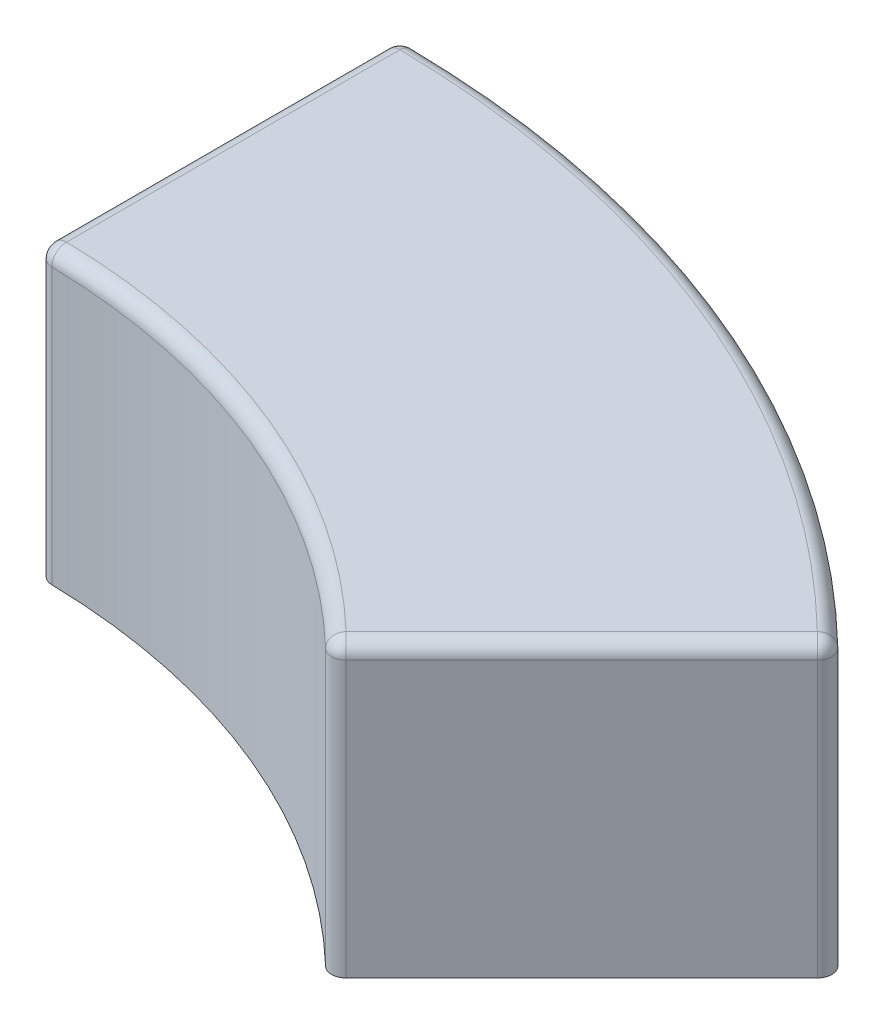
ISO-10303-21;
HEADER;
FILE_DESCRIPTION(('STEP AP214'),'2;1');
FILE_NAME('part.step','',(''),(''),'','','');
FILE_SCHEMA(('AUTOMOTIVE_DESIGN { 1 0 10303 214 1 1 1 1 }'));
ENDSEC;
DATA;
#1=APPLICATION_CONTEXT('core data for automotive mechanical design processes');
#2=APPLICATION_PROTOCOL_DEFINITION('international standard','automotive_design',2000,#1);
#3=PRODUCT_CONTEXT('',#1,'mechanical');
#4=PRODUCT('Part','Part','',(#3));
#5=PRODUCT_RELATED_PRODUCT_CATEGORY('part','',(#4));
#6=PRODUCT_DEFINITION_FORMATION('','',#4);
#7=PRODUCT_DEFINITION_CONTEXT('part definition',#1,'design');
#8=PRODUCT_DEFINITION('design','',#6,#7);
#9=PRODUCT_DEFINITION_SHAPE('','',#8);
#10=(LENGTH_UNIT() NAMED_UNIT(*) SI_UNIT(.MILLI.,.METRE.));
#11=(NAMED_UNIT(*) PLANE_ANGLE_UNIT() SI_UNIT($,.RADIAN.));
#12=(NAMED_UNIT(*) SI_UNIT($,.STERADIAN.) SOLID_ANGLE_UNIT());
#13=UNCERTAINTY_MEASURE_WITH_UNIT(LENGTH_MEASURE(1.E-05),#10,'distance_accuracy_value','');
#14=(GEOMETRIC_REPRESENTATION_CONTEXT(3) GLOBAL_UNCERTAINTY_ASSIGNED_CONTEXT((#13)) GLOBAL_UNIT_ASSIGNED_CONTEXT((#10,
#11,#12)) REPRESENTATION_CONTEXT('',''));
#15=CARTESIAN_POINT('',(0.,0.,0.));
#16=DIRECTION('',(0.,0.,1.));
#17=DIRECTION('',(1.,0.,0.));
#18=AXIS2_PLACEMENT_3D('',#15,#16,#17);
#19=CARTESIAN_POINT('',(0.,400.,0.));
#20=DIRECTION('',(0.,-1.,0.));
#21=DIRECTION('',(0.,0.,-1.));
#22=AXIS2_PLACEMENT_3D('',#19,#20,#21);
#23=CYLINDRICAL_SURFACE('',#22,1460.);
#24=CARTESIAN_POINT('',(0.,380.,0.));
#25=DIRECTION('',(0.,-1.,0.));
#26=DIRECTION('',(0.,0.,-1.));
#27=AXIS2_PLACEMENT_3D('',#24,#25,#26);
#28=CIRCLE('',#27,1460.);
#29=CARTESIAN_POINT('',(20.2777777777778,380.,-1459.85917530712));
#30=VERTEX_POINT('',#29);
#31=CARTESIAN_POINT('',(1017.93776826301,380.,-1046.61487661113));
#32=VERTEX_POINT('',#31);
#33=EDGE_CURVE('E234',#30,#32,#28,.T.);
#34=ORIENTED_EDGE('',*,*,#33,.T.);
#35=DIRECTION('',(0.,-1.,0.));
#36=VECTOR('',#35,1.);
#37=CARTESIAN_POINT('',(1017.93776826301,400.,-1046.61487661113));
#38=LINE('',#37,#36);
#39=CARTESIAN_POINT('',(1017.93776826301,0.,-1046.61487661113));
#40=VERTEX_POINT('',#39);
#41=EDGE_CURVE('E238',#32,#40,#38,.T.);
#42=ORIENTED_EDGE('',*,*,#41,.T.);
#43=CARTESIAN_POINT('',(0.,0.,0.));
#44=DIRECTION('',(0.,1.,0.));
#45=DIRECTION('',(0.,0.,-1.));
#46=AXIS2_PLACEMENT_3D('',#43,#44,#45);
#47=CIRCLE('',#46,1460.);
#48=CARTESIAN_POINT('',(20.2777777777778,0.,-1459.85917530712));
#49=VERTEX_POINT('',#48);
#50=EDGE_CURVE('E203',#40,#49,#47,.T.);
#51=ORIENTED_EDGE('',*,*,#50,.T.);
#52=DIRECTION('',(0.,-1.,0.));
#53=VECTOR('',#52,1.);
#54=CARTESIAN_POINT('',(20.2777777777778,400.,-1459.85917530712));
#55=LINE('',#54,#53);
#56=EDGE_CURVE('E231',#49,#30,#55,.F.);
#57=ORIENTED_EDGE('',*,*,#56,.T.);
#58=EDGE_LOOP('',(#34,#42,#51,#57));
#59=FACE_BOUND('',#58,.T.);
#60=ADVANCED_FACE('F47',(#59),#23,.T.);
#61=CARTESIAN_POINT('',(0.,400.,-960.));
#62=DIRECTION('',(1.,0.,0.));
#63=DIRECTION('',(0.,0.,-1.));
#64=AXIS2_PLACEMENT_3D('',#61,#62,#63);
#65=PLANE('',#64);
#66=DIRECTION('',(0.,0.,1.));
#67=VECTOR('',#66,1.);
#68=CARTESIAN_POINT('',(0.,380.,-960.));
#69=LINE('',#68,#67);
#70=CARTESIAN_POINT('',(0.,380.,-979.795897113271));
#71=VERTEX_POINT('',#70);
#72=CARTESIAN_POINT('',(0.,380.,-1439.86110441251));
#73=VERTEX_POINT('',#72);
#74=EDGE_CURVE('E265',#71,#73,#69,.F.);
#75=ORIENTED_EDGE('',*,*,#74,.T.);
#76=DIRECTION('',(0.,-1.,0.));
#77=VECTOR('',#76,1.);
#78=CARTESIAN_POINT('',(0.,400.,-1439.86110441251));
#79=LINE('',#78,#77);
#80=CARTESIAN_POINT('',(0.,0.,-1439.86110441251));
#81=VERTEX_POINT('',#80);
#82=EDGE_CURVE('E268',#73,#81,#79,.T.);
#83=ORIENTED_EDGE('',*,*,#82,.T.);
#84=DIRECTION('',(0.,0.,1.));
#85=VECTOR('',#84,1.);
#86=CARTESIAN_POINT('',(0.,0.,-960.));
#87=LINE('',#86,#85);
#88=CARTESIAN_POINT('',(0.,0.,-979.795897113271));
#89=VERTEX_POINT('',#88);
#90=EDGE_CURVE('E207',#81,#89,#87,.T.);
#91=ORIENTED_EDGE('',*,*,#90,.T.);
#92=DIRECTION('',(0.,-1.,0.));
#93=VECTOR('',#92,1.);
#94=CARTESIAN_POINT('',(0.,400.,-979.795897113271));
#95=LINE('',#94,#93);
#96=EDGE_CURVE('E262',#89,#71,#95,.F.);
#97=ORIENTED_EDGE('',*,*,#96,.T.);
#98=EDGE_LOOP('',(#75,#83,#91,#97));
#99=FACE_BOUND('',#98,.T.);
#100=ADVANCED_FACE('F376',(#99),#65,.F.);
#101=CARTESIAN_POINT('',(0.,400.,0.));
#102=DIRECTION('',(0.,-1.,0.));
#103=DIRECTION('',(0.,0.,-1.));
#104=AXIS2_PLACEMENT_3D('',#101,#102,#103);
#105=CYLINDRICAL_SURFACE('',#104,960.);
#106=CARTESIAN_POINT('',(0.,380.,0.));
#107=DIRECTION('',(0.,-1.,0.));
#108=DIRECTION('',(0.,0.,-1.));
#109=AXIS2_PLACEMENT_3D('',#106,#107,#108);
#110=CIRCLE('',#109,960.);
#111=CARTESIAN_POINT('',(664.827612150682,380.,-692.534653372683));
#112=VERTEX_POINT('',#111);
#113=CARTESIAN_POINT('',(19.5918367346939,380.,-959.800062478306));
#114=VERTEX_POINT('',#113);
#115=EDGE_CURVE('E57',#112,#114,#110,.F.);
#116=ORIENTED_EDGE('',*,*,#115,.T.);
#117=DIRECTION('',(0.,-1.,0.));
#118=VECTOR('',#117,1.);
#119=CARTESIAN_POINT('',(19.5918367346939,400.,-959.800062478307));
#120=LINE('',#119,#118);
#121=CARTESIAN_POINT('',(19.5918367346939,0.,-959.800062478306));
#122=VERTEX_POINT('',#121);
#123=EDGE_CURVE('E11',#114,#122,#120,.T.);
#124=ORIENTED_EDGE('',*,*,#123,.T.);
#125=CARTESIAN_POINT('',(0.,0.,0.));
#126=DIRECTION('',(0.,-1.,0.));
#127=DIRECTION('',(0.,0.,-1.));
#128=AXIS2_PLACEMENT_3D('',#125,#126,#127);
#129=CIRCLE('',#128,960.);
#130=CARTESIAN_POINT('',(664.827612150682,0.,-692.534653372683));
#131=VERTEX_POINT('',#130);
#132=EDGE_CURVE('E211',#122,#131,#129,.T.);
#133=ORIENTED_EDGE('',*,*,#132,.T.);
#134=DIRECTION('',(0.,-1.,0.));
#135=VECTOR('',#134,1.);
#136=CARTESIAN_POINT('',(664.827612150682,400.,-692.534653372683));
#137=LINE('',#136,#135);
#138=EDGE_CURVE('E68',#131,#112,#137,.F.);
#139=ORIENTED_EDGE('',*,*,#138,.T.);
#140=EDGE_LOOP('',(#116,#124,#133,#139));
#141=FACE_BOUND('',#140,.T.);
#142=ADVANCED_FACE('F348',(#141),#105,.F.);
#143=CARTESIAN_POINT('',(678.822509939087,400.,-678.822509939084));
#144=DIRECTION('',(-0.707106781186547,0.,-0.707106781186549));
#145=DIRECTION('',(-0.707106781186549,0.,0.707106781186547));
#146=AXIS2_PLACEMENT_3D('',#143,#144,#145);
#147=PLANE('',#146);
#148=DIRECTION('',(0.707106781186549,0.,-0.707106781186547));
#149=VECTOR('',#148,1.);
#150=CARTESIAN_POINT('',(678.822509939087,0.,-678.822509939084));
#151=LINE('',#150,#149);
#152=CARTESIAN_POINT('',(692.820323027552,0.,-692.82032302755));
#153=VERTEX_POINT('',#152);
#154=CARTESIAN_POINT('',(1018.13555089684,0.,-1018.13555089683));
#155=VERTEX_POINT('',#154);
#156=EDGE_CURVE('E214',#153,#155,#151,.T.);
#157=ORIENTED_EDGE('',*,*,#156,.T.);
#158=DIRECTION('',(0.,-1.,0.));
#159=VECTOR('',#158,1.);
#160=CARTESIAN_POINT('',(1018.13555089684,400.,-1018.13555089683));
#161=LINE('',#160,#159);
#162=CARTESIAN_POINT('',(1018.13555089684,380.,-1018.13555089683));
#163=VERTEX_POINT('',#162);
#164=EDGE_CURVE('E259',#155,#163,#161,.F.);
#165=ORIENTED_EDGE('',*,*,#164,.T.);
#166=DIRECTION('',(0.707106781186549,0.,-0.707106781186547));
#167=VECTOR('',#166,1.);
#168=CARTESIAN_POINT('',(678.822509939087,380.,-678.822509939084));
#169=LINE('',#168,#167);
#170=CARTESIAN_POINT('',(692.820323027552,380.,-692.82032302755));
#171=VERTEX_POINT('',#170);
#172=EDGE_CURVE('E256',#163,#171,#169,.F.);
#173=ORIENTED_EDGE('',*,*,#172,.T.);
#174=DIRECTION('',(0.,-1.,0.));
#175=VECTOR('',#174,1.);
#176=CARTESIAN_POINT('',(692.820323027552,400.,-692.82032302755));
#177=LINE('',#176,#175);
#178=EDGE_CURVE('E253',#171,#153,#177,.T.);
#179=ORIENTED_EDGE('',*,*,#178,.T.);
#180=EDGE_LOOP('',(#157,#165,#173,#179));
#181=FACE_BOUND('',#180,.T.);
#182=ADVANCED_FACE('F356',(#181),#147,.F.);
#183=CARTESIAN_POINT('',(0.,400.,0.));
#184=DIRECTION('',(0.,-1.,0.));
#185=DIRECTION('',(0.,0.,-1.));
#186=AXIS2_PLACEMENT_3D('',#183,#184,#185);
#187=PLANE('',#186);
#188=DIRECTION('',(0.707106781186549,0.,-0.707106781186547));
#189=VECTOR('',#188,1.);
#190=CARTESIAN_POINT('',(-14.1421356237306,400.,-14.1421356237306));
#191=LINE('',#190,#189);
#192=CARTESIAN_POINT('',(678.678187403821,400.,-706.96245865128));
#193=VERTEX_POINT('',#192);
#194=CARTESIAN_POINT('',(1003.99341527311,400.,-1032.27768652056));
#195=VERTEX_POINT('',#194);
#196=EDGE_CURVE('E218',#193,#195,#191,.T.);
#197=ORIENTED_EDGE('',*,*,#196,.T.);
#198=CARTESIAN_POINT('',(0.,400.,0.));
#199=DIRECTION('',(0.,-1.,0.));
#200=DIRECTION('',(0.,0.,-1.));
#201=AXIS2_PLACEMENT_3D('',#198,#199,#200);
#202=CIRCLE('',#201,1440.);
#203=CARTESIAN_POINT('',(20.,400.,-1439.86110441251));
#204=VERTEX_POINT('',#203);
#205=EDGE_CURVE('E227',#195,#204,#202,.F.);
#206=ORIENTED_EDGE('',*,*,#205,.T.);
#207=DIRECTION('',(0.,0.,1.));
#208=VECTOR('',#207,1.);
#209=CARTESIAN_POINT('',(20.,400.,0.));
#210=LINE('',#209,#208);
#211=CARTESIAN_POINT('',(20.,400.,-979.795897113271));
#212=VERTEX_POINT('',#211);
#213=EDGE_CURVE('E224',#204,#212,#210,.T.);
#214=ORIENTED_EDGE('',*,*,#213,.T.);
#215=CARTESIAN_POINT('',(0.,400.,0.));
#216=DIRECTION('',(0.,-1.,0.));
#217=DIRECTION('',(0.,0.,-1.));
#218=AXIS2_PLACEMENT_3D('',#215,#216,#217);
#219=CIRCLE('',#218,980.);
#220=EDGE_CURVE('E221',#212,#193,#219,.T.);
#221=ORIENTED_EDGE('',*,*,#220,.T.);
#222=EDGE_LOOP('',(#197,#206,#214,#221));
#223=FACE_BOUND('',#222,.T.);
#224=ADVANCED_FACE('F331',(#223),#187,.F.);
#225=CARTESIAN_POINT('',(0.,0.,0.));
#226=DIRECTION('',(0.,-1.,0.));
#227=DIRECTION('',(0.,0.,-1.));
#228=AXIS2_PLACEMENT_3D('',#225,#226,#227);
#229=PLANE('',#228);
#230=ORIENTED_EDGE('',*,*,#50,.F.);
#231=CARTESIAN_POINT('',(1003.9934152731,0.,-1032.27768652056));
#232=DIRECTION('',(0.,-1.,0.));
#233=DIRECTION('',(0.,0.,-1.));
#234=AXIS2_PLACEMENT_3D('',#231,#232,#233);
#235=CIRCLE('',#234,20.);
#236=EDGE_CURVE('E250',#40,#155,#235,.T.);
#237=ORIENTED_EDGE('',*,*,#236,.T.);
#238=ORIENTED_EDGE('',*,*,#156,.F.);
#239=CARTESIAN_POINT('',(678.678187403821,0.,-706.962458651281));
#240=DIRECTION('',(0.,-1.,0.));
#241=DIRECTION('',(0.,0.,-1.));
#242=AXIS2_PLACEMENT_3D('',#239,#240,#241);
#243=CIRCLE('',#242,20.);
#244=EDGE_CURVE('E241',#153,#131,#243,.T.);
#245=ORIENTED_EDGE('',*,*,#244,.T.);
#246=ORIENTED_EDGE('',*,*,#132,.F.);
#247=CARTESIAN_POINT('',(20.,0.,-979.795897113271));
#248=DIRECTION('',(0.,-1.,0.));
#249=DIRECTION('',(0.,0.,-1.));
#250=AXIS2_PLACEMENT_3D('',#247,#248,#249);
#251=CIRCLE('',#250,20.);
#252=EDGE_CURVE('E244',#122,#89,#251,.T.);
#253=ORIENTED_EDGE('',*,*,#252,.T.);
#254=ORIENTED_EDGE('',*,*,#90,.F.);
#255=CARTESIAN_POINT('',(20.,0.,-1439.86110441251));
#256=DIRECTION('',(0.,-1.,0.));
#257=DIRECTION('',(0.,0.,-1.));
#258=AXIS2_PLACEMENT_3D('',#255,#256,#257);
#259=CIRCLE('',#258,20.);
#260=EDGE_CURVE('E247',#81,#49,#259,.T.);
#261=ORIENTED_EDGE('',*,*,#260,.T.);
#262=EDGE_LOOP('',(#230,#237,#238,#245,#246,#253,#254,#261));
#263=FACE_BOUND('',#262,.T.);
#264=ADVANCED_FACE('F351',(#263),#229,.T.);
#265=CARTESIAN_POINT('',(678.678187403821,400.,-706.962458651281));
#266=DIRECTION('',(0.,-1.,0.));
#267=DIRECTION('',(0.,0.,-1.));
#268=AXIS2_PLACEMENT_3D('',#265,#266,#267);
#269=CYLINDRICAL_SURFACE('',#268,20.);
#270=ORIENTED_EDGE('',*,*,#244,.F.);
#271=ORIENTED_EDGE('',*,*,#178,.F.);
#272=CARTESIAN_POINT('',(678.678187403821,380.,-706.962458651281));
#273=DIRECTION('',(0.,1.,0.));
#274=DIRECTION('',(0.,0.,1.));
#275=AXIS2_PLACEMENT_3D('',#272,#273,#274);
#276=CIRCLE('',#275,20.);
#277=EDGE_CURVE('E51',#112,#171,#276,.T.);
#278=ORIENTED_EDGE('',*,*,#277,.F.);
#279=ORIENTED_EDGE('',*,*,#138,.F.);
#280=EDGE_LOOP('',(#270,#271,#278,#279));
#281=FACE_BOUND('',#280,.T.);
#282=ADVANCED_FACE('F49',(#281),#269,.T.);
#283=CARTESIAN_POINT('',(0.,380.,0.));
#284=DIRECTION('',(0.,-1.,0.));
#285=DIRECTION('',(0.,0.,-1.));
#286=AXIS2_PLACEMENT_3D('',#283,#284,#285);
#287=TOROIDAL_SURFACE('',#286,980.,20.);
#288=CARTESIAN_POINT('',(20.,380.,-979.795897113271));
#289=DIRECTION('',(-0.999791731748236,0.,-0.0204081632653062));
#290=DIRECTION('',(-0.0204081632653062,0.,0.999791731748236));
#291=AXIS2_PLACEMENT_3D('',#288,#289,#290);
#292=CIRCLE('',#291,20.);
#293=EDGE_CURVE('E308',#114,#212,#292,.T.);
#294=ORIENTED_EDGE('',*,*,#293,.F.);
#295=ORIENTED_EDGE('',*,*,#115,.F.);
#296=CARTESIAN_POINT('',(678.678187403821,380.,-706.96245865128));
#297=DIRECTION('',(0.721390263929871,0.,0.692528762656968));
#298=DIRECTION('',(0.692528762656968,0.,-0.721390263929871));
#299=AXIS2_PLACEMENT_3D('',#296,#297,#298);
#300=CIRCLE('',#299,20.);
#301=EDGE_CURVE('E311',#193,#112,#300,.T.);
#302=ORIENTED_EDGE('',*,*,#301,.F.);
#303=ORIENTED_EDGE('',*,*,#220,.F.);
#304=EDGE_LOOP('',(#294,#295,#302,#303));
#305=FACE_BOUND('',#304,.T.);
#306=ADVANCED_FACE('F337',(#305),#287,.T.);
#307=CARTESIAN_POINT('',(20.,400.,-979.795897113271));
#308=DIRECTION('',(0.,-1.,0.));
#309=DIRECTION('',(0.,0.,-1.));
#310=AXIS2_PLACEMENT_3D('',#307,#308,#309);
#311=CYLINDRICAL_SURFACE('',#310,20.);
#312=ORIENTED_EDGE('',*,*,#252,.F.);
#313=ORIENTED_EDGE('',*,*,#123,.F.);
#314=CARTESIAN_POINT('',(20.,380.,-979.795897113271));
#315=DIRECTION('',(0.,1.,0.));
#316=DIRECTION('',(0.,0.,1.));
#317=AXIS2_PLACEMENT_3D('',#314,#315,#316);
#318=CIRCLE('',#317,20.);
#319=EDGE_CURVE('E304',#71,#114,#318,.T.);
#320=ORIENTED_EDGE('',*,*,#319,.F.);
#321=ORIENTED_EDGE('',*,*,#96,.F.);
#322=EDGE_LOOP('',(#312,#313,#320,#321));
#323=FACE_BOUND('',#322,.T.);
#324=ADVANCED_FACE('F346',(#323),#311,.T.);
#325=CARTESIAN_POINT('',(678.678187403821,380.,-706.962458651281));
#326=DIRECTION('',(0.,1.,0.));
#327=DIRECTION('',(0.,0.,1.));
#328=AXIS2_PLACEMENT_3D('',#325,#326,#327);
#329=SPHERICAL_SURFACE('',#328,20.);
#330=ORIENTED_EDGE('',*,*,#301,.T.);
#331=ORIENTED_EDGE('',*,*,#277,.T.);
#332=CARTESIAN_POINT('',(678.678187403821,380.,-706.962458651281));
#333=DIRECTION('',(-0.70710678118655,0.,0.707106781186545));
#334=DIRECTION('',(0.707106781186545,0.,0.70710678118655));
#335=AXIS2_PLACEMENT_3D('',#332,#333,#334);
#336=CIRCLE('',#335,20.);
#337=EDGE_CURVE('E300',#193,#171,#336,.F.);
#338=ORIENTED_EDGE('',*,*,#337,.F.);
#339=EDGE_LOOP('',(#330,#331,#338));
#340=FACE_BOUND('',#339,.T.);
#341=ADVANCED_FACE('F320',(#340),#329,.T.);
#342=CARTESIAN_POINT('',(20.,380.,-979.795897113271));
#343=DIRECTION('',(0.,1.,0.));
#344=DIRECTION('',(0.,0.,1.));
#345=AXIS2_PLACEMENT_3D('',#342,#343,#344);
#346=SPHERICAL_SURFACE('',#345,20.);
#347=ORIENTED_EDGE('',*,*,#319,.T.);
#348=ORIENTED_EDGE('',*,*,#293,.T.);
#349=CARTESIAN_POINT('',(20.,380.,-979.795897113271));
#350=DIRECTION('',(0.,0.,1.));
#351=DIRECTION('',(1.,0.,0.));
#352=AXIS2_PLACEMENT_3D('',#349,#350,#351);
#353=CIRCLE('',#352,20.);
#354=EDGE_CURVE('E296',#71,#212,#353,.F.);
#355=ORIENTED_EDGE('',*,*,#354,.F.);
#356=EDGE_LOOP('',(#347,#348,#355));
#357=FACE_BOUND('',#356,.T.);
#358=ADVANCED_FACE('F341',(#357),#346,.T.);
#359=CARTESIAN_POINT('',(1003.9934152731,400.,-1032.27768652056));
#360=DIRECTION('',(0.,-1.,0.));
#361=DIRECTION('',(0.,0.,-1.));
#362=AXIS2_PLACEMENT_3D('',#359,#360,#361);
#363=CYLINDRICAL_SURFACE('',#362,20.);
#364=ORIENTED_EDGE('',*,*,#236,.F.);
#365=ORIENTED_EDGE('',*,*,#41,.F.);
#366=CARTESIAN_POINT('',(1003.9934152731,380.,-1032.27768652056));
#367=DIRECTION('',(0.,1.,0.));
#368=DIRECTION('',(0.,0.,1.));
#369=AXIS2_PLACEMENT_3D('',#366,#367,#368);
#370=CIRCLE('',#369,20.);
#371=EDGE_CURVE('E292',#163,#32,#370,.T.);
#372=ORIENTED_EDGE('',*,*,#371,.F.);
#373=ORIENTED_EDGE('',*,*,#164,.F.);
#374=EDGE_LOOP('',(#364,#365,#372,#373));
#375=FACE_BOUND('',#374,.T.);
#376=ADVANCED_FACE('F360',(#375),#363,.T.);
#377=CARTESIAN_POINT('',(-14.1421356237306,380.,-14.1421356237307));
#378=DIRECTION('',(0.707106781186549,0.,-0.707106781186547));
#379=DIRECTION('',(-0.707106781186547,0.,-0.707106781186549));
#380=AXIS2_PLACEMENT_3D('',#377,#378,#379);
#381=CYLINDRICAL_SURFACE('',#380,20.);
#382=ORIENTED_EDGE('',*,*,#337,.T.);
#383=ORIENTED_EDGE('',*,*,#172,.F.);
#384=CARTESIAN_POINT('',(1003.99341527311,380.,-1032.27768652056));
#385=DIRECTION('',(0.707106781186553,0.,-0.707106781186542));
#386=DIRECTION('',(-0.707106781186542,0.,-0.707106781186553));
#387=AXIS2_PLACEMENT_3D('',#384,#385,#386);
#388=CIRCLE('',#387,20.);
#389=EDGE_CURVE('E288',#195,#163,#388,.T.);
#390=ORIENTED_EDGE('',*,*,#389,.F.);
#391=ORIENTED_EDGE('',*,*,#196,.F.);
#392=EDGE_LOOP('',(#382,#383,#390,#391));
#393=FACE_BOUND('',#392,.T.);
#394=ADVANCED_FACE('F326',(#393),#381,.T.);
#395=CARTESIAN_POINT('',(20.,380.,0.));
#396=DIRECTION('',(0.,0.,1.));
#397=DIRECTION('',(1.,0.,0.));
#398=AXIS2_PLACEMENT_3D('',#395,#396,#397);
#399=CYLINDRICAL_SURFACE('',#398,20.);
#400=ORIENTED_EDGE('',*,*,#354,.T.);
#401=ORIENTED_EDGE('',*,*,#213,.F.);
#402=CARTESIAN_POINT('',(20.,380.,-1439.86110441251));
#403=DIRECTION('',(0.,0.,-1.));
#404=DIRECTION('',(-1.,0.,0.));
#405=AXIS2_PLACEMENT_3D('',#402,#403,#404);
#406=CIRCLE('',#405,20.);
#407=EDGE_CURVE('E284',#73,#204,#406,.T.);
#408=ORIENTED_EDGE('',*,*,#407,.F.);
#409=ORIENTED_EDGE('',*,*,#74,.F.);
#410=EDGE_LOOP('',(#400,#401,#408,#409));
#411=FACE_BOUND('',#410,.T.);
#412=ADVANCED_FACE('F373',(#411),#399,.T.);
#413=CARTESIAN_POINT('',(20.,400.,-1439.86110441251));
#414=DIRECTION('',(0.,-1.,0.));
#415=DIRECTION('',(0.,0.,-1.));
#416=AXIS2_PLACEMENT_3D('',#413,#414,#415);
#417=CYLINDRICAL_SURFACE('',#416,20.);
#418=ORIENTED_EDGE('',*,*,#260,.F.);
#419=ORIENTED_EDGE('',*,*,#82,.F.);
#420=CARTESIAN_POINT('',(20.,380.,-1439.86110441251));
#421=DIRECTION('',(0.,1.,0.));
#422=DIRECTION('',(0.,0.,1.));
#423=AXIS2_PLACEMENT_3D('',#420,#421,#422);
#424=CIRCLE('',#423,20.);
#425=EDGE_CURVE('E280',#30,#73,#424,.T.);
#426=ORIENTED_EDGE('',*,*,#425,.F.);
#427=ORIENTED_EDGE('',*,*,#56,.F.);
#428=EDGE_LOOP('',(#418,#419,#426,#427));
#429=FACE_BOUND('',#428,.T.);
#430=ADVANCED_FACE('F379',(#429),#417,.T.);
#431=CARTESIAN_POINT('',(1003.9934152731,380.,-1032.27768652056));
#432=DIRECTION('',(0.,1.,0.));
#433=DIRECTION('',(-1.,0.,0.));
#434=AXIS2_PLACEMENT_3D('',#431,#432,#433);
#435=SPHERICAL_SURFACE('',#434,20.);
#436=ORIENTED_EDGE('',*,*,#389,.T.);
#437=ORIENTED_EDGE('',*,*,#371,.T.);
#438=CARTESIAN_POINT('',(1003.9934152731,380.,-1032.27768652056));
#439=DIRECTION('',(0.71685950452817,0.,0.697217649495211));
#440=DIRECTION('',(0.697217649495211,0.,-0.71685950452817));
#441=AXIS2_PLACEMENT_3D('',#438,#439,#440);
#442=CIRCLE('',#441,20.);
#443=EDGE_CURVE('E277',#195,#32,#442,.F.);
#444=ORIENTED_EDGE('',*,*,#443,.F.);
#445=EDGE_LOOP('',(#436,#437,#444));
#446=FACE_BOUND('',#445,.T.);
#447=ADVANCED_FACE('F363',(#446),#435,.T.);
#448=CARTESIAN_POINT('',(20.,380.,-1439.86110441251));
#449=DIRECTION('',(0.,1.,0.));
#450=DIRECTION('',(0.,0.,1.));
#451=AXIS2_PLACEMENT_3D('',#448,#449,#450);
#452=SPHERICAL_SURFACE('',#451,20.);
#453=ORIENTED_EDGE('',*,*,#425,.T.);
#454=ORIENTED_EDGE('',*,*,#407,.T.);
#455=CARTESIAN_POINT('',(20.,380.,-1439.86110441251));
#456=DIRECTION('',(-0.999903544730907,0.,-0.0138888888888888));
#457=DIRECTION('',(-0.0138888888888888,0.,0.999903544730907));
#458=AXIS2_PLACEMENT_3D('',#455,#456,#457);
#459=CIRCLE('',#458,20.);
#460=EDGE_CURVE('E197',#30,#204,#459,.F.);
#461=ORIENTED_EDGE('',*,*,#460,.F.);
#462=EDGE_LOOP('',(#453,#454,#461));
#463=FACE_BOUND('',#462,.T.);
#464=ADVANCED_FACE('F370',(#463),#452,.T.);
#465=CARTESIAN_POINT('',(0.,380.,0.));
#466=DIRECTION('',(0.,-1.,0.));
#467=DIRECTION('',(0.,0.,-1.));
#468=AXIS2_PLACEMENT_3D('',#465,#466,#467);
#469=TOROIDAL_SURFACE('',#468,1440.,20.);
#470=ORIENTED_EDGE('',*,*,#443,.T.);
#471=ORIENTED_EDGE('',*,*,#33,.F.);
#472=ORIENTED_EDGE('',*,*,#460,.T.);
#473=ORIENTED_EDGE('',*,*,#205,.F.);
#474=EDGE_LOOP('',(#470,#471,#472,#473));
#475=FACE_BOUND('',#474,.T.);
#476=ADVANCED_FACE('F366',(#475),#469,.T.);
#477=CLOSED_SHELL('',(#60,#100,#142,#182,#224,#264,#282,#306,#324,#341,#358,#376,#394,#412,#430,
#447,#464,#476));
#478=CARTESIAN_POINT('',(0.,20.,0.));
#479=DIRECTION('',(0.,1.,0.));
#480=DIRECTION('',(0.,0.,1.));
#481=AXIS2_PLACEMENT_3D('',#478,#479,#480);
#482=CYLINDRICAL_SURFACE('',#481,980.);
#483=CARTESIAN_POINT('',(0.,380.,0.));
#484=DIRECTION('',(0.,1.,0.));
#485=DIRECTION('',(0.,0.,1.));
#486=AXIS2_PLACEMENT_3D('',#483,#484,#485);
#487=CIRCLE('',#486,980.);
#488=CARTESIAN_POINT('',(20.,380.,-979.795897113271));
#489=VERTEX_POINT('',#488);
#490=CARTESIAN_POINT('',(678.678187403821,380.,-706.96245865128));
#491=VERTEX_POINT('',#490);
#492=EDGE_CURVE('E155',#489,#491,#487,.F.);
#493=ORIENTED_EDGE('',*,*,#492,.T.);
#494=DIRECTION('',(0.,1.,0.));
#495=VECTOR('',#494,1.);
#496=CARTESIAN_POINT('',(678.678187403821,20.,-706.96245865128));
#497=LINE('',#496,#495);
#498=CARTESIAN_POINT('',(678.678187403821,20.,-706.96245865128));
#499=VERTEX_POINT('',#498);
#500=EDGE_CURVE('E148',#499,#491,#497,.T.);
#501=ORIENTED_EDGE('',*,*,#500,.F.);
#502=CARTESIAN_POINT('',(0.,20.,0.));
#503=DIRECTION('',(0.,1.,0.));
#504=DIRECTION('',(0.,0.,1.));
#505=AXIS2_PLACEMENT_3D('',#502,#503,#504);
#506=CIRCLE('',#505,980.);
#507=CARTESIAN_POINT('',(20.,20.,-979.795897113271));
#508=VERTEX_POINT('',#507);
#509=EDGE_CURVE('E152',#508,#499,#506,.F.);
#510=ORIENTED_EDGE('',*,*,#509,.F.);
#511=DIRECTION('',(0.,1.,0.));
#512=VECTOR('',#511,1.);
#513=CARTESIAN_POINT('',(20.,20.,-979.795897113271));
#514=LINE('',#513,#512);
#515=EDGE_CURVE('E194',#508,#489,#514,.T.);
#516=ORIENTED_EDGE('',*,*,#515,.T.);
#517=EDGE_LOOP('',(#493,#501,#510,#516));
#518=FACE_BOUND('',#517,.T.);
#519=ADVANCED_FACE('F150',(#518),#482,.T.);
#520=CARTESIAN_POINT('',(20.,20.,0.));
#521=DIRECTION('',(-1.,0.,0.));
#522=DIRECTION('',(0.,0.,1.));
#523=AXIS2_PLACEMENT_3D('',#520,#521,#522);
#524=PLANE('',#523);
#525=DIRECTION('',(0.,0.,1.));
#526=VECTOR('',#525,1.);
#527=CARTESIAN_POINT('',(20.,380.,0.));
#528=LINE('',#527,#526);
#529=CARTESIAN_POINT('',(20.,380.,-1439.86110441251));
#530=VERTEX_POINT('',#529);
#531=EDGE_CURVE('E175',#530,#489,#528,.T.);
#532=ORIENTED_EDGE('',*,*,#531,.T.);
#533=ORIENTED_EDGE('',*,*,#515,.F.);
#534=DIRECTION('',(0.,0.,1.));
#535=VECTOR('',#534,1.);
#536=CARTESIAN_POINT('',(20.,20.,0.));
#537=LINE('',#536,#535);
#538=CARTESIAN_POINT('',(20.,20.,-1439.86110441251));
#539=VERTEX_POINT('',#538);
#540=EDGE_CURVE('E161',#539,#508,#537,.T.);
#541=ORIENTED_EDGE('',*,*,#540,.F.);
#542=DIRECTION('',(0.,1.,0.));
#543=VECTOR('',#542,1.);
#544=CARTESIAN_POINT('',(20.,20.,-1439.86110441251));
#545=LINE('',#544,#543);
#546=EDGE_CURVE('E198',#539,#530,#545,.T.);
#547=ORIENTED_EDGE('',*,*,#546,.T.);
#548=EDGE_LOOP('',(#532,#533,#541,#547));
#549=FACE_BOUND('',#548,.T.);
#550=ADVANCED_FACE('F521',(#549),#524,.F.);
#551=CARTESIAN_POINT('',(0.,20.,0.));
#552=DIRECTION('',(0.,1.,0.));
#553=DIRECTION('',(0.,0.,1.));
#554=AXIS2_PLACEMENT_3D('',#551,#552,#553);
#555=CYLINDRICAL_SURFACE('',#554,1440.);
#556=CARTESIAN_POINT('',(0.,380.,0.));
#557=DIRECTION('',(0.,1.,0.));
#558=DIRECTION('',(0.,0.,1.));
#559=AXIS2_PLACEMENT_3D('',#556,#557,#558);
#560=CIRCLE('',#559,1440.);
#561=CARTESIAN_POINT('',(1003.99341527311,380.,-1032.27768652056));
#562=VERTEX_POINT('',#561);
#563=EDGE_CURVE('E179',#562,#530,#560,.T.);
#564=ORIENTED_EDGE('',*,*,#563,.T.);
#565=ORIENTED_EDGE('',*,*,#546,.F.);
#566=CARTESIAN_POINT('',(0.,20.,0.));
#567=DIRECTION('',(0.,1.,0.));
#568=DIRECTION('',(0.,0.,1.));
#569=AXIS2_PLACEMENT_3D('',#566,#567,#568);
#570=CIRCLE('',#569,1440.);
#571=CARTESIAN_POINT('',(1003.99341527311,20.,-1032.27768652056));
#572=VERTEX_POINT('',#571);
#573=EDGE_CURVE('E170',#572,#539,#570,.T.);
#574=ORIENTED_EDGE('',*,*,#573,.F.);
#575=DIRECTION('',(0.,1.,0.));
#576=VECTOR('',#575,1.);
#577=CARTESIAN_POINT('',(1003.99341527311,20.,-1032.27768652056));
#578=LINE('',#577,#576);
#579=EDGE_CURVE('E160',#572,#562,#578,.T.);
#580=ORIENTED_EDGE('',*,*,#579,.T.);
#581=EDGE_LOOP('',(#564,#565,#574,#580));
#582=FACE_BOUND('',#581,.T.);
#583=ADVANCED_FACE('F533',(#582),#555,.F.);
#584=CARTESIAN_POINT('',(-14.1421356237306,20.,-14.1421356237306));
#585=DIRECTION('',(0.707106781186546,0.,0.707106781186548));
#586=DIRECTION('',(0.707106781186549,0.,-0.707106781186547));
#587=AXIS2_PLACEMENT_3D('',#584,#585,#586);
#588=PLANE('',#587);
#589=DIRECTION('',(0.707106781186549,0.,-0.707106781186547));
#590=VECTOR('',#589,1.);
#591=CARTESIAN_POINT('',(-14.1421356237306,380.,-14.1421356237306));
#592=LINE('',#591,#590);
#593=EDGE_CURVE('E188',#491,#562,#592,.T.);
#594=ORIENTED_EDGE('',*,*,#593,.T.);
#595=ORIENTED_EDGE('',*,*,#579,.F.);
#596=DIRECTION('',(0.707106781186549,0.,-0.707106781186547));
#597=VECTOR('',#596,1.);
#598=CARTESIAN_POINT('',(-14.1421356237306,20.,-14.1421356237306));
#599=LINE('',#598,#597);
#600=EDGE_CURVE('E164',#499,#572,#599,.T.);
#601=ORIENTED_EDGE('',*,*,#600,.F.);
#602=ORIENTED_EDGE('',*,*,#500,.T.);
#603=EDGE_LOOP('',(#594,#595,#601,#602));
#604=FACE_BOUND('',#603,.T.);
#605=ADVANCED_FACE('F165',(#604),#588,.F.);
#606=CARTESIAN_POINT('',(0.,20.,0.));
#607=DIRECTION('',(0.,1.,0.));
#608=DIRECTION('',(0.,0.,1.));
#609=AXIS2_PLACEMENT_3D('',#606,#607,#608);
#610=PLANE('',#609);
#611=ORIENTED_EDGE('',*,*,#509,.T.);
#612=ORIENTED_EDGE('',*,*,#600,.T.);
#613=ORIENTED_EDGE('',*,*,#573,.T.);
#614=ORIENTED_EDGE('',*,*,#540,.T.);
#615=EDGE_LOOP('',(#611,#612,#613,#614));
#616=FACE_BOUND('',#615,.T.);
#617=ADVANCED_FACE('F172',(#616),#610,.T.);
#618=CARTESIAN_POINT('',(0.,380.,0.));
#619=DIRECTION('',(0.,1.,0.));
#620=DIRECTION('',(0.,0.,1.));
#621=AXIS2_PLACEMENT_3D('',#618,#619,#620);
#622=PLANE('',#621);
#623=ORIENTED_EDGE('',*,*,#492,.F.);
#624=ORIENTED_EDGE('',*,*,#531,.F.);
#625=ORIENTED_EDGE('',*,*,#563,.F.);
#626=ORIENTED_EDGE('',*,*,#593,.F.);
#627=EDGE_LOOP('',(#623,#624,#625,#626));
#628=FACE_BOUND('',#627,.T.);
#629=ADVANCED_FACE('F569',(#628),#622,.F.);
#630=CLOSED_SHELL('',(#519,#550,#583,#605,#617,#629));
#631=ORIENTED_CLOSED_SHELL('',*,#630,.T.);
#632=BREP_WITH_VOIDS('B2',#477,(#631));
#633=ADVANCED_BREP_SHAPE_REPRESENTATION('',(#18,#632),#14);
#634=SHAPE_DEFINITION_REPRESENTATION(#9,#633);
ENDSEC;
END-ISO-10303-21;
